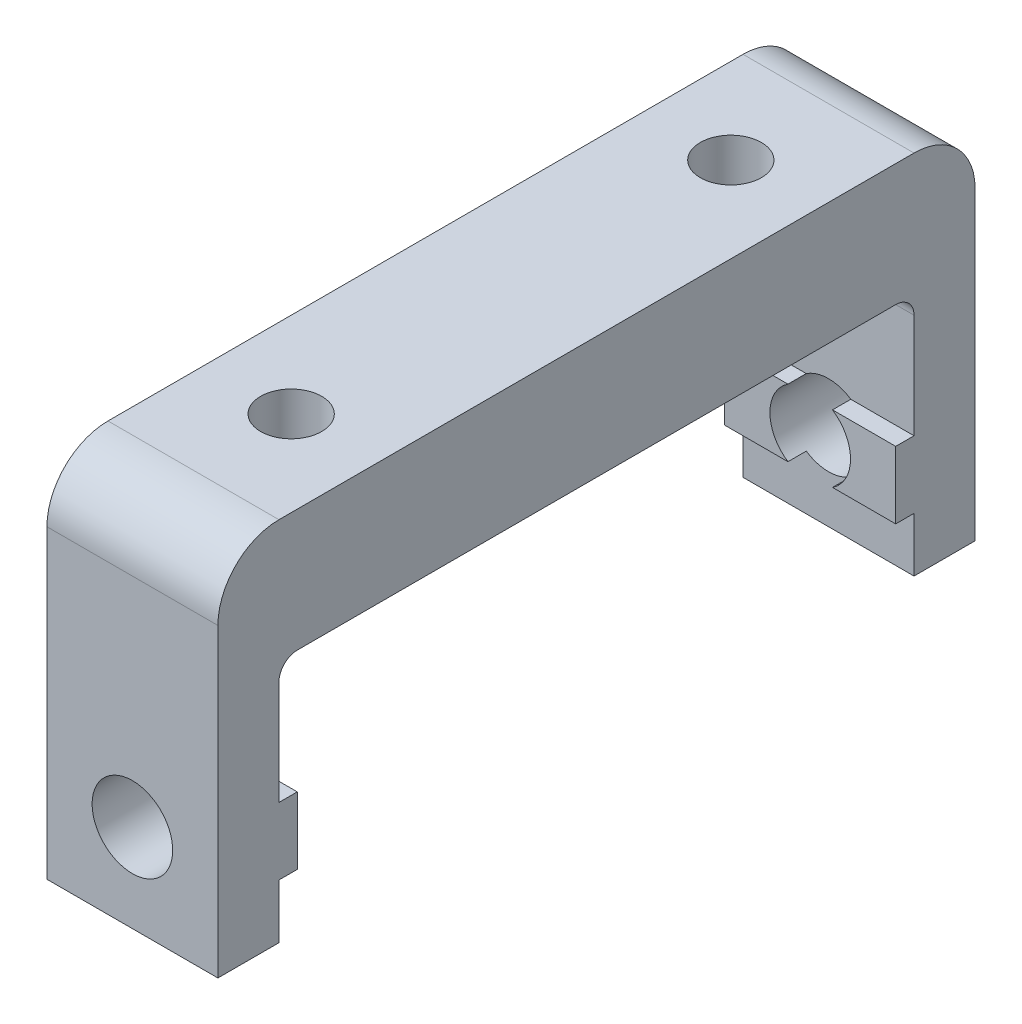
ISO-10303-21;
HEADER;
FILE_DESCRIPTION(('STEP AP214'),'2;1');
FILE_NAME('part.step','',(''),(''),'','','');
FILE_SCHEMA(('AUTOMOTIVE_DESIGN { 1 0 10303 214 1 1 1 1 }'));
ENDSEC;
DATA;
#1=APPLICATION_CONTEXT('core data for automotive mechanical design processes');
#2=APPLICATION_PROTOCOL_DEFINITION('international standard','automotive_design',2000,#1);
#3=PRODUCT_CONTEXT('',#1,'mechanical');
#4=PRODUCT('Part','Part','',(#3));
#5=PRODUCT_RELATED_PRODUCT_CATEGORY('part','',(#4));
#6=PRODUCT_DEFINITION_FORMATION('','',#4);
#7=PRODUCT_DEFINITION_CONTEXT('part definition',#1,'design');
#8=PRODUCT_DEFINITION('design','',#6,#7);
#9=PRODUCT_DEFINITION_SHAPE('','',#8);
#10=(LENGTH_UNIT() NAMED_UNIT(*) SI_UNIT(.MILLI.,.METRE.));
#11=(NAMED_UNIT(*) PLANE_ANGLE_UNIT() SI_UNIT($,.RADIAN.));
#12=(NAMED_UNIT(*) SI_UNIT($,.STERADIAN.) SOLID_ANGLE_UNIT());
#13=UNCERTAINTY_MEASURE_WITH_UNIT(LENGTH_MEASURE(1.E-05),#10,'distance_accuracy_value','');
#14=(GEOMETRIC_REPRESENTATION_CONTEXT(3) GLOBAL_UNCERTAINTY_ASSIGNED_CONTEXT((#13)) GLOBAL_UNIT_ASSIGNED_CONTEXT((#10,
#11,#12)) REPRESENTATION_CONTEXT('',''));
#15=CARTESIAN_POINT('',(0.,0.,0.));
#16=DIRECTION('',(0.,0.,1.));
#17=DIRECTION('',(1.,0.,0.));
#18=AXIS2_PLACEMENT_3D('',#15,#16,#17);
#19=CARTESIAN_POINT('',(14.,-20.05,-24.5));
#20=DIRECTION('',(0.,1.,0.));
#21=DIRECTION('',(-1.,0.,0.));
#22=AXIS2_PLACEMENT_3D('',#19,#20,#21);
#23=PLANE('',#22);
#24=DIRECTION('',(0.,0.,-1.));
#25=VECTOR('',#24,1.);
#26=CARTESIAN_POINT('',(5.17585636530455,-20.05,31.001));
#27=LINE('',#26,#25);
#28=CARTESIAN_POINT('',(5.17585636530453,-20.05,-26.));
#29=VERTEX_POINT('',#28);
#30=CARTESIAN_POINT('',(5.17585636530455,-20.05,-24.5));
#31=VERTEX_POINT('',#30);
#32=EDGE_CURVE('E437',#29,#31,#27,.F.);
#33=ORIENTED_EDGE('',*,*,#32,.F.);
#34=DIRECTION('',(1.,0.,0.));
#35=VECTOR('',#34,1.);
#36=CARTESIAN_POINT('',(14.,-20.05,-26.));
#37=LINE('',#36,#35);
#38=CARTESIAN_POINT('',(0.,-20.05,-26.));
#39=VERTEX_POINT('',#38);
#40=EDGE_CURVE('E258',#39,#29,#37,.T.);
#41=ORIENTED_EDGE('',*,*,#40,.F.);
#42=DIRECTION('',(0.,0.,-1.));
#43=VECTOR('',#42,1.);
#44=CARTESIAN_POINT('',(0.,-20.05,-24.5));
#45=LINE('',#44,#43);
#46=CARTESIAN_POINT('',(0.,-20.05,-24.5));
#47=VERTEX_POINT('',#46);
#48=EDGE_CURVE('E269',#47,#39,#45,.T.);
#49=ORIENTED_EDGE('',*,*,#48,.F.);
#50=DIRECTION('',(1.,0.,0.));
#51=VECTOR('',#50,1.);
#52=CARTESIAN_POINT('',(14.,-20.05,-24.5));
#53=LINE('',#52,#51);
#54=EDGE_CURVE('E244',#47,#31,#53,.T.);
#55=ORIENTED_EDGE('',*,*,#54,.T.);
#56=EDGE_LOOP('',(#33,#41,#49,#55));
#57=FACE_BOUND('',#56,.T.);
#58=ADVANCED_FACE('F33',(#57),#23,.T.);
#59=CARTESIAN_POINT('',(14.,-25.55,-24.5));
#60=DIRECTION('',(0.,-1.,0.));
#61=DIRECTION('',(0.,0.,-1.));
#62=AXIS2_PLACEMENT_3D('',#59,#60,#61);
#63=PLANE('',#62);
#64=DIRECTION('',(0.,0.,-1.));
#65=VECTOR('',#64,1.);
#66=CARTESIAN_POINT('',(8.8241436346955,-25.55,31.001));
#67=LINE('',#66,#65);
#68=CARTESIAN_POINT('',(8.8241436346955,-25.55,-26.));
#69=VERTEX_POINT('',#68);
#70=CARTESIAN_POINT('',(8.8241436346955,-25.55,-24.5));
#71=VERTEX_POINT('',#70);
#72=EDGE_CURVE('E223',#69,#71,#67,.F.);
#73=ORIENTED_EDGE('',*,*,#72,.F.);
#74=DIRECTION('',(-1.,0.,0.));
#75=VECTOR('',#74,1.);
#76=CARTESIAN_POINT('',(14.,-25.55,-26.));
#77=LINE('',#76,#75);
#78=CARTESIAN_POINT('',(14.,-25.55,-26.));
#79=VERTEX_POINT('',#78);
#80=EDGE_CURVE('E248',#79,#69,#77,.T.);
#81=ORIENTED_EDGE('',*,*,#80,.F.);
#82=DIRECTION('',(0.,0.,-1.));
#83=VECTOR('',#82,1.);
#84=CARTESIAN_POINT('',(14.,-25.55,-24.5));
#85=LINE('',#84,#83);
#86=CARTESIAN_POINT('',(14.,-25.55,-24.5));
#87=VERTEX_POINT('',#86);
#88=EDGE_CURVE('E257',#87,#79,#85,.T.);
#89=ORIENTED_EDGE('',*,*,#88,.F.);
#90=DIRECTION('',(-1.,0.,0.));
#91=VECTOR('',#90,1.);
#92=CARTESIAN_POINT('',(14.,-25.55,-24.5));
#93=LINE('',#92,#91);
#94=EDGE_CURVE('E255',#87,#71,#93,.T.);
#95=ORIENTED_EDGE('',*,*,#94,.T.);
#96=EDGE_LOOP('',(#73,#81,#89,#95));
#97=FACE_BOUND('',#96,.T.);
#98=ADVANCED_FACE('F504',(#97),#63,.T.);
#99=CARTESIAN_POINT('',(0.,0.,-24.5));
#100=DIRECTION('',(0.,0.,1.));
#101=DIRECTION('',(-1.,0.,0.));
#102=AXIS2_PLACEMENT_3D('',#99,#100,#101);
#103=PLANE('',#102);
#104=CARTESIAN_POINT('',(7.,-22.8,-24.5));
#105=DIRECTION('',(0.,0.,1.));
#106=DIRECTION('',(1.,0.,0.));
#107=AXIS2_PLACEMENT_3D('',#104,#105,#106);
#108=CIRCLE('',#107,3.3);
#109=CARTESIAN_POINT('',(5.1758563653045,-25.55,-24.5));
#110=VERTEX_POINT('',#109);
#111=EDGE_CURVE('E230',#31,#110,#108,.T.);
#112=ORIENTED_EDGE('',*,*,#111,.F.);
#113=ORIENTED_EDGE('',*,*,#54,.F.);
#114=DIRECTION('',(0.,1.,0.));
#115=VECTOR('',#114,1.);
#116=CARTESIAN_POINT('',(0.,-20.05,-24.5));
#117=LINE('',#116,#115);
#118=CARTESIAN_POINT('',(0.,-25.55,-24.5));
#119=VERTEX_POINT('',#118);
#120=EDGE_CURVE('E247',#119,#47,#117,.T.);
#121=ORIENTED_EDGE('',*,*,#120,.F.);
#122=EDGE_CURVE('E254',#110,#119,#93,.T.);
#123=ORIENTED_EDGE('',*,*,#122,.F.);
#124=EDGE_LOOP('',(#112,#113,#121,#123));
#125=FACE_BOUND('',#124,.T.);
#126=ADVANCED_FACE('F509',(#125),#103,.T.);
#127=CARTESIAN_POINT('',(14.,-30.,-26.));
#128=DIRECTION('',(0.,0.,1.));
#129=DIRECTION('',(0.,-1.,0.));
#130=AXIS2_PLACEMENT_3D('',#127,#128,#129);
#131=PLANE('',#130);
#132=DIRECTION('',(0.,1.,0.));
#133=VECTOR('',#132,1.);
#134=CARTESIAN_POINT('',(14.,-30.,-26.));
#135=LINE('',#134,#133);
#136=CARTESIAN_POINT('',(14.,-20.05,-26.));
#137=VERTEX_POINT('',#136);
#138=CARTESIAN_POINT('',(14.,-11.5,-26.));
#139=VERTEX_POINT('',#138);
#140=EDGE_CURVE('E278',#137,#139,#135,.T.);
#141=ORIENTED_EDGE('',*,*,#140,.T.);
#142=DIRECTION('',(-1.,0.,0.));
#143=VECTOR('',#142,1.);
#144=CARTESIAN_POINT('',(14.,-11.5,-26.));
#145=LINE('',#144,#143);
#146=CARTESIAN_POINT('',(0.,-11.5,-26.));
#147=VERTEX_POINT('',#146);
#148=EDGE_CURVE('E419',#139,#147,#145,.T.);
#149=ORIENTED_EDGE('',*,*,#148,.T.);
#150=DIRECTION('',(0.,1.,0.));
#151=VECTOR('',#150,1.);
#152=CARTESIAN_POINT('',(0.,-30.,-26.));
#153=LINE('',#152,#151);
#154=EDGE_CURVE('E274',#39,#147,#153,.T.);
#155=ORIENTED_EDGE('',*,*,#154,.F.);
#156=ORIENTED_EDGE('',*,*,#40,.T.);
#157=CARTESIAN_POINT('',(7.,-22.8,-26.));
#158=DIRECTION('',(0.,0.,1.));
#159=DIRECTION('',(0.,-1.,0.));
#160=AXIS2_PLACEMENT_3D('',#157,#158,#159);
#161=CIRCLE('',#160,3.3);
#162=CARTESIAN_POINT('',(8.82414363469546,-20.05,-26.));
#163=VERTEX_POINT('',#162);
#164=EDGE_CURVE('E438',#163,#29,#161,.T.);
#165=ORIENTED_EDGE('',*,*,#164,.F.);
#166=EDGE_CURVE('E237',#163,#137,#37,.T.);
#167=ORIENTED_EDGE('',*,*,#166,.T.);
#168=EDGE_LOOP('',(#141,#149,#155,#156,#165,#167));
#169=FACE_BOUND('',#168,.T.);
#170=ADVANCED_FACE('F425',(#169),#131,.T.);
#171=CARTESIAN_POINT('',(14.,-10.,26.));
#172=DIRECTION('',(0.,1.,0.));
#173=DIRECTION('',(0.,0.,1.));
#174=AXIS2_PLACEMENT_3D('',#171,#172,#173);
#175=PLANE('',#174);
#176=CARTESIAN_POINT('',(7.,-10.,-18.));
#177=DIRECTION('',(0.,-1.,0.));
#178=DIRECTION('',(0.,0.,-1.));
#179=AXIS2_PLACEMENT_3D('',#176,#177,#178);
#180=CIRCLE('',#179,4.5);
#181=CARTESIAN_POINT('',(7.,-10.,-22.5));
#182=VERTEX_POINT('',#181);
#183=EDGE_CURVE('E455',#182,#182,#180,.T.);
#184=ORIENTED_EDGE('',*,*,#183,.F.);
#185=EDGE_LOOP('',(#184));
#186=FACE_BOUND('',#185,.T.);
#187=DIRECTION('',(0.,0.,-1.));
#188=VECTOR('',#187,1.);
#189=CARTESIAN_POINT('',(0.,-10.,26.));
#190=LINE('',#189,#188);
#191=CARTESIAN_POINT('',(0.,-10.,24.5));
#192=VERTEX_POINT('',#191);
#193=CARTESIAN_POINT('',(0.,-10.,-24.5));
#194=VERTEX_POINT('',#193);
#195=EDGE_CURVE('E364',#192,#194,#190,.T.);
#196=ORIENTED_EDGE('',*,*,#195,.T.);
#197=DIRECTION('',(-1.,0.,0.));
#198=VECTOR('',#197,1.);
#199=CARTESIAN_POINT('',(14.,-10.,-24.5));
#200=LINE('',#199,#198);
#201=CARTESIAN_POINT('',(14.,-10.,-24.5));
#202=VERTEX_POINT('',#201);
#203=EDGE_CURVE('E54',#194,#202,#200,.F.);
#204=ORIENTED_EDGE('',*,*,#203,.T.);
#205=DIRECTION('',(0.,0.,-1.));
#206=VECTOR('',#205,1.);
#207=CARTESIAN_POINT('',(14.,-10.,26.));
#208=LINE('',#207,#206);
#209=CARTESIAN_POINT('',(14.,-10.,24.5));
#210=VERTEX_POINT('',#209);
#211=EDGE_CURVE('E372',#210,#202,#208,.T.);
#212=ORIENTED_EDGE('',*,*,#211,.F.);
#213=DIRECTION('',(-1.,0.,0.));
#214=VECTOR('',#213,1.);
#215=CARTESIAN_POINT('',(0.,-10.,24.5));
#216=LINE('',#215,#214);
#217=EDGE_CURVE('E401',#210,#192,#216,.T.);
#218=ORIENTED_EDGE('',*,*,#217,.T.);
#219=EDGE_LOOP('',(#196,#204,#212,#218));
#220=FACE_BOUND('',#219,.T.);
#221=CARTESIAN_POINT('',(7.,-10.,18.));
#222=DIRECTION('',(0.,1.,0.));
#223=DIRECTION('',(0.,0.,1.));
#224=AXIS2_PLACEMENT_3D('',#221,#222,#223);
#225=CIRCLE('',#224,4.5);
#226=CARTESIAN_POINT('',(7.,-10.,22.5));
#227=VERTEX_POINT('',#226);
#228=EDGE_CURVE('E299',#227,#227,#225,.T.);
#229=ORIENTED_EDGE('',*,*,#228,.T.);
#230=EDGE_LOOP('',(#229));
#231=FACE_BOUND('',#230,.T.);
#232=ADVANCED_FACE('F479',(#186,#220,#231),#175,.F.);
#233=CARTESIAN_POINT('',(14.,-30.,26.));
#234=DIRECTION('',(0.,0.,1.));
#235=DIRECTION('',(0.,-1.,0.));
#236=AXIS2_PLACEMENT_3D('',#233,#234,#235);
#237=PLANE('',#236);
#238=CARTESIAN_POINT('',(7.,-22.8,26.));
#239=DIRECTION('',(0.,0.,1.));
#240=DIRECTION('',(0.,-1.,0.));
#241=AXIS2_PLACEMENT_3D('',#238,#239,#240);
#242=CIRCLE('',#241,3.3);
#243=CARTESIAN_POINT('',(8.82414363469549,-25.55,26.));
#244=VERTEX_POINT('',#243);
#245=CARTESIAN_POINT('',(5.17585636530451,-25.55,26.));
#246=VERTEX_POINT('',#245);
#247=EDGE_CURVE('E318',#244,#246,#242,.F.);
#248=ORIENTED_EDGE('',*,*,#247,.F.);
#249=DIRECTION('',(-1.,0.,0.));
#250=VECTOR('',#249,1.);
#251=CARTESIAN_POINT('',(14.,-25.55,26.));
#252=LINE('',#251,#250);
#253=CARTESIAN_POINT('',(14.,-25.55,26.));
#254=VERTEX_POINT('',#253);
#255=EDGE_CURVE('E343',#254,#244,#252,.T.);
#256=ORIENTED_EDGE('',*,*,#255,.F.);
#257=DIRECTION('',(0.,1.,0.));
#258=VECTOR('',#257,1.);
#259=CARTESIAN_POINT('',(14.,-30.,26.));
#260=LINE('',#259,#258);
#261=CARTESIAN_POINT('',(14.,-30.,26.));
#262=VERTEX_POINT('',#261);
#263=EDGE_CURVE('E369',#262,#254,#260,.T.);
#264=ORIENTED_EDGE('',*,*,#263,.F.);
#265=DIRECTION('',(-1.,0.,0.));
#266=VECTOR('',#265,1.);
#267=CARTESIAN_POINT('',(14.,-30.,26.));
#268=LINE('',#267,#266);
#269=CARTESIAN_POINT('',(0.,-30.,26.));
#270=VERTEX_POINT('',#269);
#271=EDGE_CURVE('E374',#262,#270,#268,.T.);
#272=ORIENTED_EDGE('',*,*,#271,.T.);
#273=DIRECTION('',(0.,1.,0.));
#274=VECTOR('',#273,1.);
#275=CARTESIAN_POINT('',(0.,-30.,26.));
#276=LINE('',#275,#274);
#277=CARTESIAN_POINT('',(0.,-25.55,26.));
#278=VERTEX_POINT('',#277);
#279=EDGE_CURVE('E381',#270,#278,#276,.T.);
#280=ORIENTED_EDGE('',*,*,#279,.T.);
#281=EDGE_CURVE('E327',#246,#278,#252,.T.);
#282=ORIENTED_EDGE('',*,*,#281,.F.);
#283=EDGE_LOOP('',(#248,#256,#264,#272,#280,#282));
#284=FACE_BOUND('',#283,.T.);
#285=ADVANCED_FACE('F481',(#284),#237,.F.);
#286=CARTESIAN_POINT('',(0.,-20.05,26.));
#287=VERTEX_POINT('',#286);
#288=CARTESIAN_POINT('',(0.,-11.5,26.));
#289=VERTEX_POINT('',#288);
#290=EDGE_CURVE('E380',#287,#289,#276,.T.);
#291=ORIENTED_EDGE('',*,*,#290,.T.);
#292=DIRECTION('',(-1.,0.,0.));
#293=VECTOR('',#292,1.);
#294=CARTESIAN_POINT('',(14.,-11.5,26.));
#295=LINE('',#294,#293);
#296=CARTESIAN_POINT('',(14.,-11.5,26.));
#297=VERTEX_POINT('',#296);
#298=EDGE_CURVE('E404',#289,#297,#295,.F.);
#299=ORIENTED_EDGE('',*,*,#298,.T.);
#300=CARTESIAN_POINT('',(14.,-20.05,26.));
#301=VERTEX_POINT('',#300);
#302=EDGE_CURVE('E368',#301,#297,#260,.T.);
#303=ORIENTED_EDGE('',*,*,#302,.F.);
#304=DIRECTION('',(1.,0.,0.));
#305=VECTOR('',#304,1.);
#306=CARTESIAN_POINT('',(14.,-20.05,26.));
#307=LINE('',#306,#305);
#308=CARTESIAN_POINT('',(8.82414363469547,-20.05,26.));
#309=VERTEX_POINT('',#308);
#310=EDGE_CURVE('E346',#309,#301,#307,.T.);
#311=ORIENTED_EDGE('',*,*,#310,.F.);
#312=CARTESIAN_POINT('',(7.,-22.8,26.));
#313=DIRECTION('',(0.,0.,1.));
#314=DIRECTION('',(0.,-1.,0.));
#315=AXIS2_PLACEMENT_3D('',#312,#313,#314);
#316=CIRCLE('',#315,3.3);
#317=CARTESIAN_POINT('',(5.17585636530453,-20.05,26.));
#318=VERTEX_POINT('',#317);
#319=EDGE_CURVE('E316',#318,#309,#316,.F.);
#320=ORIENTED_EDGE('',*,*,#319,.F.);
#321=EDGE_CURVE('E332',#287,#318,#307,.T.);
#322=ORIENTED_EDGE('',*,*,#321,.F.);
#323=EDGE_LOOP('',(#291,#299,#303,#311,#320,#322));
#324=FACE_BOUND('',#323,.T.);
#325=ADVANCED_FACE('F580',(#324),#237,.F.);
#326=CARTESIAN_POINT('',(14.,-25.55,24.5));
#327=DIRECTION('',(0.,1.,0.));
#328=DIRECTION('',(0.,0.,1.));
#329=AXIS2_PLACEMENT_3D('',#326,#327,#328);
#330=PLANE('',#329);
#331=DIRECTION('',(0.,0.,1.));
#332=VECTOR('',#331,1.);
#333=CARTESIAN_POINT('',(8.82414363469549,-25.55,-0.00100000000000148));
#334=LINE('',#333,#332);
#335=CARTESIAN_POINT('',(8.82414363469548,-25.55,24.5));
#336=VERTEX_POINT('',#335);
#337=EDGE_CURVE('E322',#336,#244,#334,.T.);
#338=ORIENTED_EDGE('',*,*,#337,.F.);
#339=DIRECTION('',(-1.,0.,0.));
#340=VECTOR('',#339,1.);
#341=CARTESIAN_POINT('',(14.,-25.55,24.5));
#342=LINE('',#341,#340);
#343=CARTESIAN_POINT('',(14.,-25.55,24.5));
#344=VERTEX_POINT('',#343);
#345=EDGE_CURVE('E333',#344,#336,#342,.T.);
#346=ORIENTED_EDGE('',*,*,#345,.F.);
#347=DIRECTION('',(0.,0.,1.));
#348=VECTOR('',#347,1.);
#349=CARTESIAN_POINT('',(14.,-25.55,24.5));
#350=LINE('',#349,#348);
#351=EDGE_CURVE('E357',#344,#254,#350,.T.);
#352=ORIENTED_EDGE('',*,*,#351,.T.);
#353=ORIENTED_EDGE('',*,*,#255,.T.);
#354=EDGE_LOOP('',(#338,#346,#352,#353));
#355=FACE_BOUND('',#354,.T.);
#356=ADVANCED_FACE('F564',(#355),#330,.F.);
#357=DIRECTION('',(0.,0.,1.));
#358=VECTOR('',#357,1.);
#359=CARTESIAN_POINT('',(5.17585636530451,-25.55,-0.00100000000000148));
#360=LINE('',#359,#358);
#361=CARTESIAN_POINT('',(5.17585636530451,-25.55,24.5));
#362=VERTEX_POINT('',#361);
#363=EDGE_CURVE('E314',#246,#362,#360,.F.);
#364=ORIENTED_EDGE('',*,*,#363,.F.);
#365=ORIENTED_EDGE('',*,*,#281,.T.);
#366=DIRECTION('',(0.,0.,1.));
#367=VECTOR('',#366,1.);
#368=CARTESIAN_POINT('',(0.,-25.55,24.5));
#369=LINE('',#368,#367);
#370=CARTESIAN_POINT('',(0.,-25.55,24.5));
#371=VERTEX_POINT('',#370);
#372=EDGE_CURVE('E354',#371,#278,#369,.T.);
#373=ORIENTED_EDGE('',*,*,#372,.F.);
#374=EDGE_CURVE('E331',#362,#371,#342,.T.);
#375=ORIENTED_EDGE('',*,*,#374,.F.);
#376=EDGE_LOOP('',(#364,#365,#373,#375));
#377=FACE_BOUND('',#376,.T.);
#378=ADVANCED_FACE('F599',(#377),#330,.F.);
#379=CARTESIAN_POINT('',(14.,-20.05,24.5));
#380=DIRECTION('',(0.,-1.,0.));
#381=DIRECTION('',(1.,0.,0.));
#382=AXIS2_PLACEMENT_3D('',#379,#380,#381);
#383=PLANE('',#382);
#384=DIRECTION('',(0.,0.,1.));
#385=VECTOR('',#384,1.);
#386=CARTESIAN_POINT('',(5.17585636530454,-20.05,-0.00100000000000052));
#387=LINE('',#386,#385);
#388=CARTESIAN_POINT('',(5.17585636530453,-20.05,24.5));
#389=VERTEX_POINT('',#388);
#390=EDGE_CURVE('E311',#389,#318,#387,.T.);
#391=ORIENTED_EDGE('',*,*,#390,.F.);
#392=DIRECTION('',(1.,0.,0.));
#393=VECTOR('',#392,1.);
#394=CARTESIAN_POINT('',(14.,-20.05,24.5));
#395=LINE('',#394,#393);
#396=CARTESIAN_POINT('',(0.,-20.05,24.5));
#397=VERTEX_POINT('',#396);
#398=EDGE_CURVE('E339',#397,#389,#395,.T.);
#399=ORIENTED_EDGE('',*,*,#398,.F.);
#400=DIRECTION('',(0.,0.,1.));
#401=VECTOR('',#400,1.);
#402=CARTESIAN_POINT('',(0.,-20.05,24.5));
#403=LINE('',#402,#401);
#404=EDGE_CURVE('E351',#397,#287,#403,.T.);
#405=ORIENTED_EDGE('',*,*,#404,.T.);
#406=ORIENTED_EDGE('',*,*,#321,.T.);
#407=EDGE_LOOP('',(#391,#399,#405,#406));
#408=FACE_BOUND('',#407,.T.);
#409=ADVANCED_FACE('F591',(#408),#383,.F.);
#410=DIRECTION('',(0.,0.,1.));
#411=VECTOR('',#410,1.);
#412=CARTESIAN_POINT('',(8.82414363469547,-20.05,-0.00100000000000052));
#413=LINE('',#412,#411);
#414=CARTESIAN_POINT('',(8.82414363469547,-20.05,24.5));
#415=VERTEX_POINT('',#414);
#416=EDGE_CURVE('E320',#309,#415,#413,.F.);
#417=ORIENTED_EDGE('',*,*,#416,.F.);
#418=ORIENTED_EDGE('',*,*,#310,.T.);
#419=DIRECTION('',(0.,0.,1.));
#420=VECTOR('',#419,1.);
#421=CARTESIAN_POINT('',(14.,-20.05,24.5));
#422=LINE('',#421,#420);
#423=CARTESIAN_POINT('',(14.,-20.05,24.5));
#424=VERTEX_POINT('',#423);
#425=EDGE_CURVE('E342',#424,#301,#422,.T.);
#426=ORIENTED_EDGE('',*,*,#425,.F.);
#427=EDGE_CURVE('E338',#415,#424,#395,.T.);
#428=ORIENTED_EDGE('',*,*,#427,.F.);
#429=EDGE_LOOP('',(#417,#418,#426,#428));
#430=FACE_BOUND('',#429,.T.);
#431=ADVANCED_FACE('F575',(#430),#383,.F.);
#432=CARTESIAN_POINT('',(0.,0.,24.5));
#433=DIRECTION('',(0.,0.,-1.));
#434=DIRECTION('',(-1.,0.,0.));
#435=AXIS2_PLACEMENT_3D('',#432,#433,#434);
#436=PLANE('',#435);
#437=ORIENTED_EDGE('',*,*,#345,.T.);
#438=CARTESIAN_POINT('',(7.,-22.8,24.5));
#439=DIRECTION('',(0.,0.,-1.));
#440=DIRECTION('',(-1.,0.,0.));
#441=AXIS2_PLACEMENT_3D('',#438,#439,#440);
#442=CIRCLE('',#441,3.3);
#443=EDGE_CURVE('E312',#336,#415,#442,.F.);
#444=ORIENTED_EDGE('',*,*,#443,.T.);
#445=ORIENTED_EDGE('',*,*,#427,.T.);
#446=DIRECTION('',(0.,-1.,0.));
#447=VECTOR('',#446,1.);
#448=CARTESIAN_POINT('',(14.,-20.05,24.5));
#449=LINE('',#448,#447);
#450=EDGE_CURVE('E328',#424,#344,#449,.T.);
#451=ORIENTED_EDGE('',*,*,#450,.T.);
#452=EDGE_LOOP('',(#437,#444,#445,#451));
#453=FACE_BOUND('',#452,.T.);
#454=ADVANCED_FACE('F567',(#453),#436,.T.);
#455=ORIENTED_EDGE('',*,*,#398,.T.);
#456=EDGE_CURVE('E308',#389,#362,#442,.F.);
#457=ORIENTED_EDGE('',*,*,#456,.T.);
#458=ORIENTED_EDGE('',*,*,#374,.T.);
#459=DIRECTION('',(0.,1.,0.));
#460=VECTOR('',#459,1.);
#461=CARTESIAN_POINT('',(0.,-20.05,24.5));
#462=LINE('',#461,#460);
#463=EDGE_CURVE('E336',#371,#397,#462,.T.);
#464=ORIENTED_EDGE('',*,*,#463,.T.);
#465=EDGE_LOOP('',(#455,#457,#458,#464));
#466=FACE_BOUND('',#465,.T.);
#467=ADVANCED_FACE('F593',(#466),#436,.T.);
#468=CARTESIAN_POINT('',(14.,0.,0.));
#469=DIRECTION('',(0.,-1.,0.));
#470=DIRECTION('',(0.,0.,-1.));
#471=AXIS2_PLACEMENT_3D('',#468,#469,#470);
#472=PLANE('',#471);
#473=CARTESIAN_POINT('',(7.,0.,-18.));
#474=DIRECTION('',(0.,-1.,0.));
#475=DIRECTION('',(0.,0.,-1.));
#476=AXIS2_PLACEMENT_3D('',#473,#474,#475);
#477=CIRCLE('',#476,2.5);
#478=CARTESIAN_POINT('',(7.,0.,-20.5));
#479=VERTEX_POINT('',#478);
#480=EDGE_CURVE('E228',#479,#479,#477,.T.);
#481=ORIENTED_EDGE('',*,*,#480,.T.);
#482=EDGE_LOOP('',(#481));
#483=FACE_BOUND('',#482,.T.);
#484=CARTESIAN_POINT('',(7.,0.,18.));
#485=DIRECTION('',(0.,1.,0.));
#486=DIRECTION('',(0.,0.,1.));
#487=AXIS2_PLACEMENT_3D('',#484,#485,#486);
#488=CIRCLE('',#487,2.5);
#489=CARTESIAN_POINT('',(7.,0.,20.5));
#490=VERTEX_POINT('',#489);
#491=EDGE_CURVE('E303',#490,#490,#488,.T.);
#492=ORIENTED_EDGE('',*,*,#491,.F.);
#493=EDGE_LOOP('',(#492));
#494=FACE_BOUND('',#493,.T.);
#495=DIRECTION('',(0.,0.,1.));
#496=VECTOR('',#495,1.);
#497=CARTESIAN_POINT('',(14.,0.,0.));
#498=LINE('',#497,#496);
#499=CARTESIAN_POINT('',(14.,0.,-26.));
#500=VERTEX_POINT('',#499);
#501=CARTESIAN_POINT('',(14.,0.,26.));
#502=VERTEX_POINT('',#501);
#503=EDGE_CURVE('E361',#500,#502,#498,.T.);
#504=ORIENTED_EDGE('',*,*,#503,.F.);
#505=DIRECTION('',(-1.,0.,0.));
#506=VECTOR('',#505,1.);
#507=CARTESIAN_POINT('',(0.,0.,-26.));
#508=LINE('',#507,#506);
#509=CARTESIAN_POINT('',(0.,0.,-26.));
#510=VERTEX_POINT('',#509);
#511=EDGE_CURVE('E410',#500,#510,#508,.T.);
#512=ORIENTED_EDGE('',*,*,#511,.T.);
#513=DIRECTION('',(0.,0.,1.));
#514=VECTOR('',#513,1.);
#515=CARTESIAN_POINT('',(0.,0.,0.));
#516=LINE('',#515,#514);
#517=CARTESIAN_POINT('',(0.,0.,26.));
#518=VERTEX_POINT('',#517);
#519=EDGE_CURVE('E360',#510,#518,#516,.T.);
#520=ORIENTED_EDGE('',*,*,#519,.T.);
#521=DIRECTION('',(-1.,0.,0.));
#522=VECTOR('',#521,1.);
#523=CARTESIAN_POINT('',(14.,0.,26.));
#524=LINE('',#523,#522);
#525=EDGE_CURVE('E396',#518,#502,#524,.F.);
#526=ORIENTED_EDGE('',*,*,#525,.T.);
#527=EDGE_LOOP('',(#504,#512,#520,#526));
#528=FACE_BOUND('',#527,.T.);
#529=ADVANCED_FACE('F542',(#483,#494,#528),#472,.F.);
#530=CARTESIAN_POINT('',(14.,0.,31.));
#531=DIRECTION('',(0.,0.,-1.));
#532=DIRECTION('',(0.,1.,0.));
#533=AXIS2_PLACEMENT_3D('',#530,#531,#532);
#534=PLANE('',#533);
#535=CARTESIAN_POINT('',(7.,-22.8,31.));
#536=DIRECTION('',(0.,0.,-1.));
#537=DIRECTION('',(0.,1.,0.));
#538=AXIS2_PLACEMENT_3D('',#535,#536,#537);
#539=CIRCLE('',#538,3.3);
#540=CARTESIAN_POINT('',(7.,-19.5,31.));
#541=VERTEX_POINT('',#540);
#542=EDGE_CURVE('E324',#541,#541,#539,.F.);
#543=ORIENTED_EDGE('',*,*,#542,.F.);
#544=EDGE_LOOP('',(#543));
#545=FACE_BOUND('',#544,.T.);
#546=DIRECTION('',(0.,-1.,0.));
#547=VECTOR('',#546,1.);
#548=CARTESIAN_POINT('',(14.,0.,31.));
#549=LINE('',#548,#547);
#550=CARTESIAN_POINT('',(14.,-5.,31.));
#551=VERTEX_POINT('',#550);
#552=CARTESIAN_POINT('',(14.,-30.,31.));
#553=VERTEX_POINT('',#552);
#554=EDGE_CURVE('E363',#551,#553,#549,.T.);
#555=ORIENTED_EDGE('',*,*,#554,.F.);
#556=DIRECTION('',(-1.,0.,0.));
#557=VECTOR('',#556,1.);
#558=CARTESIAN_POINT('',(14.,-5.,31.));
#559=LINE('',#558,#557);
#560=CARTESIAN_POINT('',(0.,-5.,31.));
#561=VERTEX_POINT('',#560);
#562=EDGE_CURVE('E390',#551,#561,#559,.T.);
#563=ORIENTED_EDGE('',*,*,#562,.T.);
#564=DIRECTION('',(0.,-1.,0.));
#565=VECTOR('',#564,1.);
#566=CARTESIAN_POINT('',(0.,0.,31.));
#567=LINE('',#566,#565);
#568=CARTESIAN_POINT('',(0.,-30.,31.));
#569=VERTEX_POINT('',#568);
#570=EDGE_CURVE('E376',#561,#569,#567,.T.);
#571=ORIENTED_EDGE('',*,*,#570,.T.);
#572=DIRECTION('',(-1.,0.,0.));
#573=VECTOR('',#572,1.);
#574=CARTESIAN_POINT('',(14.,-30.,31.));
#575=LINE('',#574,#573);
#576=EDGE_CURVE('E387',#553,#569,#575,.T.);
#577=ORIENTED_EDGE('',*,*,#576,.F.);
#578=EDGE_LOOP('',(#555,#563,#571,#577));
#579=FACE_BOUND('',#578,.T.);
#580=ADVANCED_FACE('F551',(#545,#579),#534,.F.);
#581=CARTESIAN_POINT('',(14.,-30.,31.));
#582=DIRECTION('',(0.,1.,0.));
#583=DIRECTION('',(0.,0.,1.));
#584=AXIS2_PLACEMENT_3D('',#581,#582,#583);
#585=PLANE('',#584);
#586=DIRECTION('',(0.,0.,-1.));
#587=VECTOR('',#586,1.);
#588=CARTESIAN_POINT('',(0.,-30.,31.));
#589=LINE('',#588,#587);
#590=EDGE_CURVE('E378',#569,#270,#589,.T.);
#591=ORIENTED_EDGE('',*,*,#590,.T.);
#592=ORIENTED_EDGE('',*,*,#271,.F.);
#593=DIRECTION('',(0.,0.,-1.));
#594=VECTOR('',#593,1.);
#595=CARTESIAN_POINT('',(14.,-30.,31.));
#596=LINE('',#595,#594);
#597=EDGE_CURVE('E366',#553,#262,#596,.T.);
#598=ORIENTED_EDGE('',*,*,#597,.F.);
#599=ORIENTED_EDGE('',*,*,#576,.T.);
#600=EDGE_LOOP('',(#591,#592,#598,#599));
#601=FACE_BOUND('',#600,.T.);
#602=ADVANCED_FACE('F557',(#601),#585,.F.);
#603=CARTESIAN_POINT('',(14.,0.,0.));
#604=DIRECTION('',(1.,0.,0.));
#605=DIRECTION('',(0.,0.,-1.));
#606=AXIS2_PLACEMENT_3D('',#603,#604,#605);
#607=PLANE('',#606);
#608=DIRECTION('',(0.,-1.,0.));
#609=VECTOR('',#608,1.);
#610=CARTESIAN_POINT('',(14.,0.,-31.));
#611=LINE('',#610,#609);
#612=CARTESIAN_POINT('',(14.,-5.,-31.));
#613=VERTEX_POINT('',#612);
#614=CARTESIAN_POINT('',(14.,-30.,-31.));
#615=VERTEX_POINT('',#614);
#616=EDGE_CURVE('E281',#613,#615,#611,.T.);
#617=ORIENTED_EDGE('',*,*,#616,.F.);
#618=CARTESIAN_POINT('',(14.,-5.,-26.));
#619=DIRECTION('',(1.,0.,0.));
#620=DIRECTION('',(0.,0.,-1.));
#621=AXIS2_PLACEMENT_3D('',#618,#619,#620);
#622=CIRCLE('',#621,5.);
#623=EDGE_CURVE('E417',#613,#500,#622,.T.);
#624=ORIENTED_EDGE('',*,*,#623,.T.);
#625=ORIENTED_EDGE('',*,*,#503,.T.);
#626=CARTESIAN_POINT('',(14.,-5.,26.));
#627=DIRECTION('',(1.,0.,0.));
#628=DIRECTION('',(0.,0.,-1.));
#629=AXIS2_PLACEMENT_3D('',#626,#627,#628);
#630=CIRCLE('',#629,5.);
#631=EDGE_CURVE('E399',#502,#551,#630,.T.);
#632=ORIENTED_EDGE('',*,*,#631,.T.);
#633=ORIENTED_EDGE('',*,*,#554,.T.);
#634=ORIENTED_EDGE('',*,*,#597,.T.);
#635=ORIENTED_EDGE('',*,*,#263,.T.);
#636=ORIENTED_EDGE('',*,*,#351,.F.);
#637=ORIENTED_EDGE('',*,*,#450,.F.);
#638=ORIENTED_EDGE('',*,*,#425,.T.);
#639=ORIENTED_EDGE('',*,*,#302,.T.);
#640=CARTESIAN_POINT('',(14.,-11.5,24.5));
#641=DIRECTION('',(1.,0.,0.));
#642=DIRECTION('',(0.,0.,-1.));
#643=AXIS2_PLACEMENT_3D('',#640,#641,#642);
#644=CIRCLE('',#643,1.5);
#645=EDGE_CURVE('E408',#297,#210,#644,.F.);
#646=ORIENTED_EDGE('',*,*,#645,.T.);
#647=ORIENTED_EDGE('',*,*,#211,.T.);
#648=CARTESIAN_POINT('',(14.,-11.5,-24.5));
#649=DIRECTION('',(1.,0.,0.));
#650=DIRECTION('',(0.,0.,-1.));
#651=AXIS2_PLACEMENT_3D('',#648,#649,#650);
#652=CIRCLE('',#651,1.5);
#653=EDGE_CURVE('E11',#202,#139,#652,.F.);
#654=ORIENTED_EDGE('',*,*,#653,.T.);
#655=ORIENTED_EDGE('',*,*,#140,.F.);
#656=DIRECTION('',(0.,0.,-1.));
#657=VECTOR('',#656,1.);
#658=CARTESIAN_POINT('',(14.,-20.05,-24.5));
#659=LINE('',#658,#657);
#660=CARTESIAN_POINT('',(14.,-20.05,-24.5));
#661=VERTEX_POINT('',#660);
#662=EDGE_CURVE('E272',#661,#137,#659,.T.);
#663=ORIENTED_EDGE('',*,*,#662,.F.);
#664=DIRECTION('',(0.,-1.,0.));
#665=VECTOR('',#664,1.);
#666=CARTESIAN_POINT('',(14.,-20.05,-24.5));
#667=LINE('',#666,#665);
#668=EDGE_CURVE('E243',#661,#87,#667,.T.);
#669=ORIENTED_EDGE('',*,*,#668,.T.);
#670=ORIENTED_EDGE('',*,*,#88,.T.);
#671=CARTESIAN_POINT('',(14.,-30.,-26.));
#672=VERTEX_POINT('',#671);
#673=EDGE_CURVE('E275',#672,#79,#135,.T.);
#674=ORIENTED_EDGE('',*,*,#673,.F.);
#675=DIRECTION('',(0.,0.,1.));
#676=VECTOR('',#675,1.);
#677=CARTESIAN_POINT('',(14.,-30.,-31.));
#678=LINE('',#677,#676);
#679=EDGE_CURVE('E277',#615,#672,#678,.T.);
#680=ORIENTED_EDGE('',*,*,#679,.F.);
#681=EDGE_LOOP('',(#617,#624,#625,#632,#633,#634,#635,#636,#637,#638,#639,#646,#647,#654,#655,
#663,#669,#670,#674,#680));
#682=FACE_BOUND('',#681,.T.);
#683=ADVANCED_FACE('F539',(#682),#607,.T.);
#684=CARTESIAN_POINT('',(0.,0.,0.));
#685=DIRECTION('',(1.,0.,0.));
#686=DIRECTION('',(0.,0.,-1.));
#687=AXIS2_PLACEMENT_3D('',#684,#685,#686);
#688=PLANE('',#687);
#689=ORIENTED_EDGE('',*,*,#519,.F.);
#690=CARTESIAN_POINT('',(0.,-5.,-26.));
#691=DIRECTION('',(1.,0.,0.));
#692=DIRECTION('',(0.,0.,-1.));
#693=AXIS2_PLACEMENT_3D('',#690,#691,#692);
#694=CIRCLE('',#693,5.);
#695=CARTESIAN_POINT('',(0.,-5.,-31.));
#696=VERTEX_POINT('',#695);
#697=EDGE_CURVE('E413',#510,#696,#694,.F.);
#698=ORIENTED_EDGE('',*,*,#697,.T.);
#699=DIRECTION('',(0.,-1.,0.));
#700=VECTOR('',#699,1.);
#701=CARTESIAN_POINT('',(0.,0.,-31.));
#702=LINE('',#701,#700);
#703=CARTESIAN_POINT('',(0.,-30.,-31.));
#704=VERTEX_POINT('',#703);
#705=EDGE_CURVE('E290',#696,#704,#702,.T.);
#706=ORIENTED_EDGE('',*,*,#705,.T.);
#707=DIRECTION('',(0.,0.,1.));
#708=VECTOR('',#707,1.);
#709=CARTESIAN_POINT('',(0.,-30.,-31.));
#710=LINE('',#709,#708);
#711=CARTESIAN_POINT('',(0.,-30.,-26.));
#712=VERTEX_POINT('',#711);
#713=EDGE_CURVE('E287',#704,#712,#710,.T.);
#714=ORIENTED_EDGE('',*,*,#713,.T.);
#715=CARTESIAN_POINT('',(0.,-25.55,-26.));
#716=VERTEX_POINT('',#715);
#717=EDGE_CURVE('E284',#712,#716,#153,.T.);
#718=ORIENTED_EDGE('',*,*,#717,.T.);
#719=DIRECTION('',(0.,0.,-1.));
#720=VECTOR('',#719,1.);
#721=CARTESIAN_POINT('',(0.,-25.55,-24.5));
#722=LINE('',#721,#720);
#723=EDGE_CURVE('E266',#119,#716,#722,.T.);
#724=ORIENTED_EDGE('',*,*,#723,.F.);
#725=ORIENTED_EDGE('',*,*,#120,.T.);
#726=ORIENTED_EDGE('',*,*,#48,.T.);
#727=ORIENTED_EDGE('',*,*,#154,.T.);
#728=CARTESIAN_POINT('',(0.,-11.5,-24.5));
#729=DIRECTION('',(1.,0.,0.));
#730=DIRECTION('',(0.,0.,-1.));
#731=AXIS2_PLACEMENT_3D('',#728,#729,#730);
#732=CIRCLE('',#731,1.5);
#733=EDGE_CURVE('E41',#147,#194,#732,.T.);
#734=ORIENTED_EDGE('',*,*,#733,.T.);
#735=ORIENTED_EDGE('',*,*,#195,.F.);
#736=CARTESIAN_POINT('',(0.,-11.5,24.5));
#737=DIRECTION('',(1.,0.,0.));
#738=DIRECTION('',(0.,0.,-1.));
#739=AXIS2_PLACEMENT_3D('',#736,#737,#738);
#740=CIRCLE('',#739,1.5);
#741=EDGE_CURVE('E406',#192,#289,#740,.T.);
#742=ORIENTED_EDGE('',*,*,#741,.T.);
#743=ORIENTED_EDGE('',*,*,#290,.F.);
#744=ORIENTED_EDGE('',*,*,#404,.F.);
#745=ORIENTED_EDGE('',*,*,#463,.F.);
#746=ORIENTED_EDGE('',*,*,#372,.T.);
#747=ORIENTED_EDGE('',*,*,#279,.F.);
#748=ORIENTED_EDGE('',*,*,#590,.F.);
#749=ORIENTED_EDGE('',*,*,#570,.F.);
#750=CARTESIAN_POINT('',(0.,-5.,26.));
#751=DIRECTION('',(1.,0.,0.));
#752=DIRECTION('',(0.,0.,-1.));
#753=AXIS2_PLACEMENT_3D('',#750,#751,#752);
#754=CIRCLE('',#753,5.);
#755=EDGE_CURVE('E393',#561,#518,#754,.F.);
#756=ORIENTED_EDGE('',*,*,#755,.T.);
#757=EDGE_LOOP('',(#689,#698,#706,#714,#718,#724,#725,#726,#727,#734,#735,#742,#743,#744,#745,
#746,#747,#748,#749,#756));
#758=FACE_BOUND('',#757,.T.);
#759=ADVANCED_FACE('F430',(#758),#688,.F.);
#760=CARTESIAN_POINT('',(7.,-22.8,31.000012));
#761=DIRECTION('',(0.,0.,-1.));
#762=DIRECTION('',(-1.,0.,0.));
#763=AXIS2_PLACEMENT_3D('',#760,#761,#762);
#764=CYLINDRICAL_SURFACE('',#763,3.3);
#765=ORIENTED_EDGE('',*,*,#337,.T.);
#766=ORIENTED_EDGE('',*,*,#247,.T.);
#767=ORIENTED_EDGE('',*,*,#363,.T.);
#768=ORIENTED_EDGE('',*,*,#456,.F.);
#769=ORIENTED_EDGE('',*,*,#390,.T.);
#770=ORIENTED_EDGE('',*,*,#319,.T.);
#771=ORIENTED_EDGE('',*,*,#416,.T.);
#772=ORIENTED_EDGE('',*,*,#443,.F.);
#773=EDGE_LOOP('',(#765,#766,#767,#768,#769,#770,#771,#772));
#774=FACE_BOUND('',#773,.T.);
#775=ORIENTED_EDGE('',*,*,#542,.T.);
#776=EDGE_LOOP('',(#775));
#777=FACE_BOUND('',#776,.T.);
#778=ADVANCED_FACE('F619',(#774,#777),#764,.F.);
#779=CARTESIAN_POINT('',(14.,-5.,26.));
#780=DIRECTION('',(-1.,0.,0.));
#781=DIRECTION('',(0.,0.,1.));
#782=AXIS2_PLACEMENT_3D('',#779,#780,#781);
#783=CYLINDRICAL_SURFACE('',#782,5.);
#784=ORIENTED_EDGE('',*,*,#631,.F.);
#785=ORIENTED_EDGE('',*,*,#525,.F.);
#786=ORIENTED_EDGE('',*,*,#755,.F.);
#787=ORIENTED_EDGE('',*,*,#562,.F.);
#788=EDGE_LOOP('',(#784,#785,#786,#787));
#789=FACE_BOUND('',#788,.T.);
#790=ADVANCED_FACE('F547',(#789),#783,.T.);
#791=CARTESIAN_POINT('',(14.,-11.5,24.5));
#792=DIRECTION('',(1.,0.,0.));
#793=DIRECTION('',(0.,0.,-1.));
#794=AXIS2_PLACEMENT_3D('',#791,#792,#793);
#795=CYLINDRICAL_SURFACE('',#794,1.5);
#796=ORIENTED_EDGE('',*,*,#645,.F.);
#797=ORIENTED_EDGE('',*,*,#298,.F.);
#798=ORIENTED_EDGE('',*,*,#741,.F.);
#799=ORIENTED_EDGE('',*,*,#217,.F.);
#800=EDGE_LOOP('',(#796,#797,#798,#799));
#801=FACE_BOUND('',#800,.T.);
#802=ADVANCED_FACE('F584',(#801),#795,.F.);
#803=CARTESIAN_POINT('',(7.,0.,18.));
#804=DIRECTION('',(0.,-1.,0.));
#805=DIRECTION('',(0.,0.,-1.));
#806=AXIS2_PLACEMENT_3D('',#803,#804,#805);
#807=CYLINDRICAL_SURFACE('',#806,2.5);
#808=CARTESIAN_POINT('',(7.,-5.4,18.));
#809=DIRECTION('',(0.,1.,0.));
#810=DIRECTION('',(0.,0.,1.));
#811=AXIS2_PLACEMENT_3D('',#808,#809,#810);
#812=CIRCLE('',#811,2.5);
#813=CARTESIAN_POINT('',(7.,-5.4,20.5));
#814=VERTEX_POINT('',#813);
#815=EDGE_CURVE('E296',#814,#814,#812,.T.);
#816=ORIENTED_EDGE('',*,*,#815,.F.);
#817=EDGE_LOOP('',(#816));
#818=FACE_BOUND('',#817,.T.);
#819=ORIENTED_EDGE('',*,*,#491,.T.);
#820=EDGE_LOOP('',(#819));
#821=FACE_BOUND('',#820,.T.);
#822=ADVANCED_FACE('F499',(#818,#821),#807,.F.);
#823=CARTESIAN_POINT('',(7.,-5.4,18.));
#824=DIRECTION('',(0.,1.,0.));
#825=DIRECTION('',(0.,0.,1.));
#826=AXIS2_PLACEMENT_3D('',#823,#824,#825);
#827=PLANE('',#826);
#828=CARTESIAN_POINT('',(7.,-5.4,18.));
#829=DIRECTION('',(0.,1.,0.));
#830=DIRECTION('',(0.,0.,1.));
#831=AXIS2_PLACEMENT_3D('',#828,#829,#830);
#832=CIRCLE('',#831,4.5);
#833=CARTESIAN_POINT('',(7.,-5.4,22.5));
#834=VERTEX_POINT('',#833);
#835=EDGE_CURVE('E300',#834,#834,#832,.T.);
#836=ORIENTED_EDGE('',*,*,#835,.F.);
#837=EDGE_LOOP('',(#836));
#838=FACE_BOUND('',#837,.T.);
#839=ORIENTED_EDGE('',*,*,#815,.T.);
#840=EDGE_LOOP('',(#839));
#841=FACE_BOUND('',#840,.T.);
#842=ADVANCED_FACE('F489',(#838,#841),#827,.F.);
#843=CARTESIAN_POINT('',(7.,-5.4,18.));
#844=DIRECTION('',(0.,-1.,0.));
#845=DIRECTION('',(0.,0.,-1.));
#846=AXIS2_PLACEMENT_3D('',#843,#844,#845);
#847=CYLINDRICAL_SURFACE('',#846,4.5);
#848=ORIENTED_EDGE('',*,*,#835,.T.);
#849=EDGE_LOOP('',(#848));
#850=FACE_BOUND('',#849,.T.);
#851=ORIENTED_EDGE('',*,*,#228,.F.);
#852=EDGE_LOOP('',(#851));
#853=FACE_BOUND('',#852,.T.);
#854=ADVANCED_FACE('F486',(#850,#853),#847,.F.);
#855=CARTESIAN_POINT('',(7.,-22.8,-26.));
#856=DIRECTION('',(0.,0.,1.));
#857=DIRECTION('',(0.,-1.,0.));
#858=AXIS2_PLACEMENT_3D('',#855,#856,#857);
#859=CIRCLE('',#858,3.3);
#860=CARTESIAN_POINT('',(5.17585636530452,-25.55,-26.));
#861=VERTEX_POINT('',#860);
#862=EDGE_CURVE('E238',#861,#69,#859,.T.);
#863=ORIENTED_EDGE('',*,*,#862,.F.);
#864=EDGE_CURVE('E261',#861,#716,#77,.T.);
#865=ORIENTED_EDGE('',*,*,#864,.T.);
#866=ORIENTED_EDGE('',*,*,#717,.F.);
#867=DIRECTION('',(-1.,0.,0.));
#868=VECTOR('',#867,1.);
#869=CARTESIAN_POINT('',(14.,-30.,-26.));
#870=LINE('',#869,#868);
#871=EDGE_CURVE('E294',#672,#712,#870,.T.);
#872=ORIENTED_EDGE('',*,*,#871,.F.);
#873=ORIENTED_EDGE('',*,*,#673,.T.);
#874=ORIENTED_EDGE('',*,*,#80,.T.);
#875=EDGE_LOOP('',(#863,#865,#866,#872,#873,#874));
#876=FACE_BOUND('',#875,.T.);
#877=ADVANCED_FACE('F488',(#876),#131,.T.);
#878=CARTESIAN_POINT('',(14.,-30.,-31.));
#879=DIRECTION('',(0.,-1.,0.));
#880=DIRECTION('',(0.,0.,-1.));
#881=AXIS2_PLACEMENT_3D('',#878,#879,#880);
#882=PLANE('',#881);
#883=ORIENTED_EDGE('',*,*,#713,.F.);
#884=DIRECTION('',(-1.,0.,0.));
#885=VECTOR('',#884,1.);
#886=CARTESIAN_POINT('',(14.,-30.,-31.));
#887=LINE('',#886,#885);
#888=EDGE_CURVE('E283',#615,#704,#887,.T.);
#889=ORIENTED_EDGE('',*,*,#888,.F.);
#890=ORIENTED_EDGE('',*,*,#679,.T.);
#891=ORIENTED_EDGE('',*,*,#871,.T.);
#892=EDGE_LOOP('',(#883,#889,#890,#891));
#893=FACE_BOUND('',#892,.T.);
#894=ADVANCED_FACE('F496',(#893),#882,.T.);
#895=CARTESIAN_POINT('',(14.,0.,-31.));
#896=DIRECTION('',(0.,0.,-1.));
#897=DIRECTION('',(0.,1.,0.));
#898=AXIS2_PLACEMENT_3D('',#895,#896,#897);
#899=PLANE('',#898);
#900=CARTESIAN_POINT('',(7.,-22.8,-31.));
#901=DIRECTION('',(0.,0.,-1.));
#902=DIRECTION('',(0.,1.,0.));
#903=AXIS2_PLACEMENT_3D('',#900,#901,#902);
#904=CIRCLE('',#903,3.3);
#905=CARTESIAN_POINT('',(7.,-19.5,-31.));
#906=VERTEX_POINT('',#905);
#907=EDGE_CURVE('E444',#906,#906,#904,.T.);
#908=ORIENTED_EDGE('',*,*,#907,.F.);
#909=EDGE_LOOP('',(#908));
#910=FACE_BOUND('',#909,.T.);
#911=ORIENTED_EDGE('',*,*,#705,.F.);
#912=DIRECTION('',(-1.,0.,0.));
#913=VECTOR('',#912,1.);
#914=CARTESIAN_POINT('',(14.,-5.,-31.));
#915=LINE('',#914,#913);
#916=EDGE_CURVE('E415',#696,#613,#915,.F.);
#917=ORIENTED_EDGE('',*,*,#916,.T.);
#918=ORIENTED_EDGE('',*,*,#616,.T.);
#919=ORIENTED_EDGE('',*,*,#888,.T.);
#920=EDGE_LOOP('',(#911,#917,#918,#919));
#921=FACE_BOUND('',#920,.T.);
#922=ADVANCED_FACE('F515',(#910,#921),#899,.T.);
#923=DIRECTION('',(0.,0.,-1.));
#924=VECTOR('',#923,1.);
#925=CARTESIAN_POINT('',(8.82414363469546,-20.05,31.001));
#926=LINE('',#925,#924);
#927=CARTESIAN_POINT('',(8.82414363469547,-20.05,-24.5));
#928=VERTEX_POINT('',#927);
#929=EDGE_CURVE('E220',#928,#163,#926,.T.);
#930=ORIENTED_EDGE('',*,*,#929,.F.);
#931=EDGE_CURVE('E235',#928,#661,#53,.T.);
#932=ORIENTED_EDGE('',*,*,#931,.T.);
#933=ORIENTED_EDGE('',*,*,#662,.T.);
#934=ORIENTED_EDGE('',*,*,#166,.F.);
#935=EDGE_LOOP('',(#930,#932,#933,#934));
#936=FACE_BOUND('',#935,.T.);
#937=ADVANCED_FACE('F233',(#936),#23,.T.);
#938=DIRECTION('',(0.,0.,-1.));
#939=VECTOR('',#938,1.);
#940=CARTESIAN_POINT('',(5.1758563653045,-25.55,31.001));
#941=LINE('',#940,#939);
#942=EDGE_CURVE('E439',#110,#861,#941,.T.);
#943=ORIENTED_EDGE('',*,*,#942,.F.);
#944=ORIENTED_EDGE('',*,*,#122,.T.);
#945=ORIENTED_EDGE('',*,*,#723,.T.);
#946=ORIENTED_EDGE('',*,*,#864,.F.);
#947=EDGE_LOOP('',(#943,#944,#945,#946));
#948=FACE_BOUND('',#947,.T.);
#949=ADVANCED_FACE('F512',(#948),#63,.T.);
#950=EDGE_CURVE('E217',#71,#928,#108,.T.);
#951=ORIENTED_EDGE('',*,*,#950,.F.);
#952=ORIENTED_EDGE('',*,*,#94,.F.);
#953=ORIENTED_EDGE('',*,*,#668,.F.);
#954=ORIENTED_EDGE('',*,*,#931,.F.);
#955=EDGE_LOOP('',(#951,#952,#953,#954));
#956=FACE_BOUND('',#955,.T.);
#957=ADVANCED_FACE('F241',(#956),#103,.T.);
#958=CARTESIAN_POINT('',(7.,-22.8,-31.000012));
#959=DIRECTION('',(0.,0.,1.));
#960=DIRECTION('',(1.,0.,0.));
#961=AXIS2_PLACEMENT_3D('',#958,#959,#960);
#962=CYLINDRICAL_SURFACE('',#961,3.3);
#963=ORIENTED_EDGE('',*,*,#907,.T.);
#964=EDGE_LOOP('',(#963));
#965=FACE_BOUND('',#964,.T.);
#966=ORIENTED_EDGE('',*,*,#111,.T.);
#967=ORIENTED_EDGE('',*,*,#942,.T.);
#968=ORIENTED_EDGE('',*,*,#862,.T.);
#969=ORIENTED_EDGE('',*,*,#72,.T.);
#970=ORIENTED_EDGE('',*,*,#950,.T.);
#971=ORIENTED_EDGE('',*,*,#929,.T.);
#972=ORIENTED_EDGE('',*,*,#164,.T.);
#973=ORIENTED_EDGE('',*,*,#32,.T.);
#974=EDGE_LOOP('',(#966,#967,#968,#969,#970,#971,#972,#973));
#975=FACE_BOUND('',#974,.T.);
#976=ADVANCED_FACE('F219',(#965,#975),#962,.F.);
#977=CARTESIAN_POINT('',(14.,-5.,-26.));
#978=DIRECTION('',(1.,0.,0.));
#979=DIRECTION('',(0.,0.,-1.));
#980=AXIS2_PLACEMENT_3D('',#977,#978,#979);
#981=CYLINDRICAL_SURFACE('',#980,5.);
#982=ORIENTED_EDGE('',*,*,#623,.F.);
#983=ORIENTED_EDGE('',*,*,#916,.F.);
#984=ORIENTED_EDGE('',*,*,#697,.F.);
#985=ORIENTED_EDGE('',*,*,#511,.F.);
#986=EDGE_LOOP('',(#982,#983,#984,#985));
#987=FACE_BOUND('',#986,.T.);
#988=ADVANCED_FACE('F535',(#987),#981,.T.);
#989=CARTESIAN_POINT('',(14.,-11.5,-24.5));
#990=DIRECTION('',(-1.,0.,0.));
#991=DIRECTION('',(0.,0.,1.));
#992=AXIS2_PLACEMENT_3D('',#989,#990,#991);
#993=CYLINDRICAL_SURFACE('',#992,1.5);
#994=ORIENTED_EDGE('',*,*,#653,.F.);
#995=ORIENTED_EDGE('',*,*,#203,.F.);
#996=ORIENTED_EDGE('',*,*,#733,.F.);
#997=ORIENTED_EDGE('',*,*,#148,.F.);
#998=EDGE_LOOP('',(#994,#995,#996,#997));
#999=FACE_BOUND('',#998,.T.);
#1000=ADVANCED_FACE('F35',(#999),#993,.F.);
#1001=CARTESIAN_POINT('',(7.,0.,-18.));
#1002=DIRECTION('',(0.,-1.,0.));
#1003=DIRECTION('',(0.,0.,-1.));
#1004=AXIS2_PLACEMENT_3D('',#1001,#1002,#1003);
#1005=CYLINDRICAL_SURFACE('',#1004,2.5);
#1006=CARTESIAN_POINT('',(7.,-5.4,-18.));
#1007=DIRECTION('',(0.,-1.,0.));
#1008=DIRECTION('',(0.,0.,-1.));
#1009=AXIS2_PLACEMENT_3D('',#1006,#1007,#1008);
#1010=CIRCLE('',#1009,2.5);
#1011=CARTESIAN_POINT('',(7.,-5.4,-20.5));
#1012=VERTEX_POINT('',#1011);
#1013=EDGE_CURVE('E458',#1012,#1012,#1010,.T.);
#1014=ORIENTED_EDGE('',*,*,#1013,.T.);
#1015=EDGE_LOOP('',(#1014));
#1016=FACE_BOUND('',#1015,.T.);
#1017=ORIENTED_EDGE('',*,*,#480,.F.);
#1018=EDGE_LOOP('',(#1017));
#1019=FACE_BOUND('',#1018,.T.);
#1020=ADVANCED_FACE('F464',(#1016,#1019),#1005,.F.);
#1021=CARTESIAN_POINT('',(7.,-5.4,-18.));
#1022=DIRECTION('',(0.,-1.,0.));
#1023=DIRECTION('',(0.,0.,-1.));
#1024=AXIS2_PLACEMENT_3D('',#1021,#1022,#1023);
#1025=CYLINDRICAL_SURFACE('',#1024,4.5);
#1026=CARTESIAN_POINT('',(7.,-5.4,-18.));
#1027=DIRECTION('',(0.,-1.,0.));
#1028=DIRECTION('',(0.,0.,-1.));
#1029=AXIS2_PLACEMENT_3D('',#1026,#1027,#1028);
#1030=CIRCLE('',#1029,4.5);
#1031=CARTESIAN_POINT('',(7.,-5.4,-22.5));
#1032=VERTEX_POINT('',#1031);
#1033=EDGE_CURVE('E454',#1032,#1032,#1030,.T.);
#1034=ORIENTED_EDGE('',*,*,#1033,.F.);
#1035=EDGE_LOOP('',(#1034));
#1036=FACE_BOUND('',#1035,.T.);
#1037=ORIENTED_EDGE('',*,*,#183,.T.);
#1038=EDGE_LOOP('',(#1037));
#1039=FACE_BOUND('',#1038,.T.);
#1040=ADVANCED_FACE('F470',(#1036,#1039),#1025,.F.);
#1041=CARTESIAN_POINT('',(7.,-5.4,-18.));
#1042=DIRECTION('',(0.,1.,0.));
#1043=DIRECTION('',(0.,0.,-1.));
#1044=AXIS2_PLACEMENT_3D('',#1041,#1042,#1043);
#1045=PLANE('',#1044);
#1046=ORIENTED_EDGE('',*,*,#1013,.F.);
#1047=EDGE_LOOP('',(#1046));
#1048=FACE_BOUND('',#1047,.T.);
#1049=ORIENTED_EDGE('',*,*,#1033,.T.);
#1050=EDGE_LOOP('',(#1049));
#1051=FACE_BOUND('',#1050,.T.);
#1052=ADVANCED_FACE('F467',(#1048,#1051),#1045,.F.);
#1053=CLOSED_SHELL('',(#58,#98,#126,#170,#232,#285,#325,#356,#378,#409,#431,#454,#467,#529,#580,
#602,#683,#759,#778,#790,#802,#822,#842,#854,#877,#894,#922,#937,#949,#957,#976,#988,#1000,
#1020,#1040,#1052));
#1054=MANIFOLD_SOLID_BREP('B2',#1053);
#1055=ADVANCED_BREP_SHAPE_REPRESENTATION('',(#18,#1054),#14);
#1056=SHAPE_DEFINITION_REPRESENTATION(#9,#1055);
ENDSEC;
END-ISO-10303-21;
